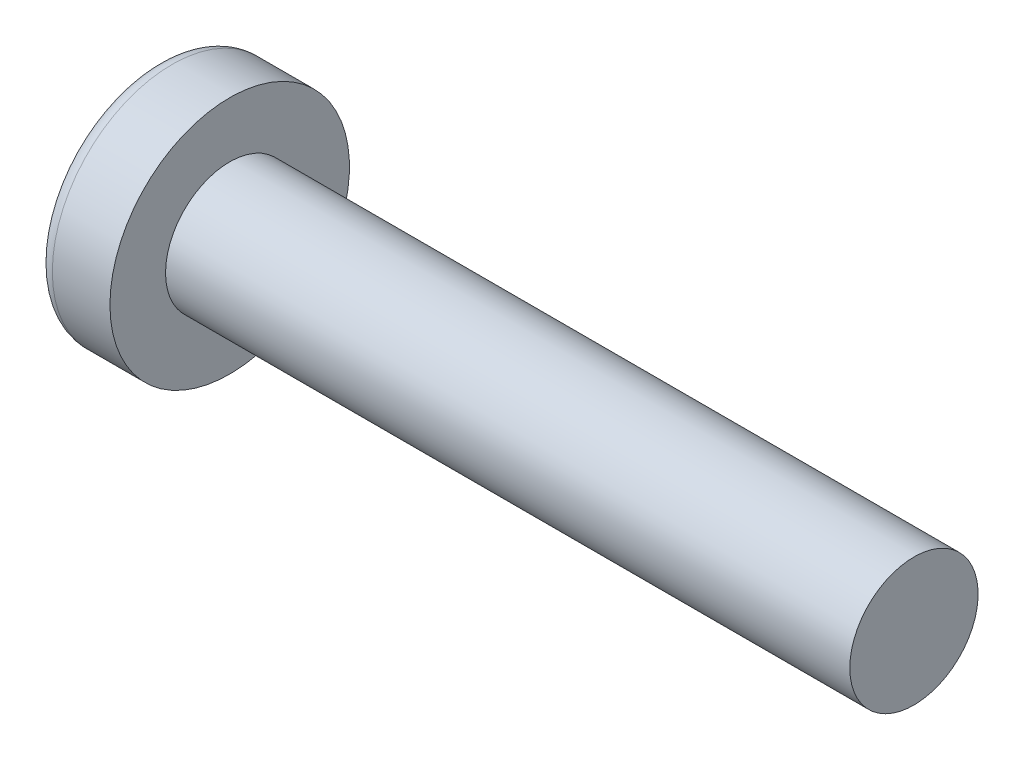
ISO-10303-21;
HEADER;
FILE_DESCRIPTION(('STEP AP214'),'2;1');
FILE_NAME('part.step','',(''),(''),'','','');
FILE_SCHEMA(('AUTOMOTIVE_DESIGN { 1 0 10303 214 1 1 1 1 }'));
ENDSEC;
DATA;
#1=APPLICATION_CONTEXT('core data for automotive mechanical design processes');
#2=APPLICATION_PROTOCOL_DEFINITION('international standard','automotive_design',2000,#1);
#3=PRODUCT_CONTEXT('',#1,'mechanical');
#4=PRODUCT('Part','Part','',(#3));
#5=PRODUCT_RELATED_PRODUCT_CATEGORY('part','',(#4));
#6=PRODUCT_DEFINITION_FORMATION('','',#4);
#7=PRODUCT_DEFINITION_CONTEXT('part definition',#1,'design');
#8=PRODUCT_DEFINITION('design','',#6,#7);
#9=PRODUCT_DEFINITION_SHAPE('','',#8);
#10=(LENGTH_UNIT() NAMED_UNIT(*) SI_UNIT(.MILLI.,.METRE.));
#11=(NAMED_UNIT(*) PLANE_ANGLE_UNIT() SI_UNIT($,.RADIAN.));
#12=(NAMED_UNIT(*) SI_UNIT($,.STERADIAN.) SOLID_ANGLE_UNIT());
#13=UNCERTAINTY_MEASURE_WITH_UNIT(LENGTH_MEASURE(1.E-05),#10,'distance_accuracy_value','');
#14=(GEOMETRIC_REPRESENTATION_CONTEXT(3) GLOBAL_UNCERTAINTY_ASSIGNED_CONTEXT((#13)) GLOBAL_UNIT_ASSIGNED_CONTEXT((#10,
#11,#12)) REPRESENTATION_CONTEXT('',''));
#15=CARTESIAN_POINT('',(0.,0.,0.));
#16=DIRECTION('',(0.,0.,1.));
#17=DIRECTION('',(1.,0.,0.));
#18=AXIS2_PLACEMENT_3D('',#15,#16,#17);
#19=CARTESIAN_POINT('',(5.,0.,0.));
#20=DIRECTION('',(-1.,0.,0.));
#21=DIRECTION('',(0.,1.,0.));
#22=AXIS2_PLACEMENT_3D('',#19,#20,#21);
#23=SPHERICAL_SURFACE('',#22,5.);
#24=CARTESIAN_POINT('',(0.747150706810477,0.,0.));
#25=DIRECTION('',(-1.,0.,0.));
#26=DIRECTION('',(0.,0.,1.));
#27=AXIS2_PLACEMENT_3D('',#24,#25,#26);
#28=CIRCLE('',#27,2.62931034482759);
#29=CARTESIAN_POINT('',(0.747150706810477,0.,2.62931034482759));
#30=VERTEX_POINT('',#29);
#31=EDGE_CURVE('E153',#30,#30,#28,.T.);
#32=ORIENTED_EDGE('',*,*,#31,.T.);
#33=EDGE_LOOP('',(#32));
#34=FACE_BOUND('',#33,.T.);
#35=CARTESIAN_POINT('',(4.98382636322272,-0.153868112043297,0.));
#36=DIRECTION('',(-0.104537710696287,-0.994520923380891,0.));
#37=DIRECTION('',(0.994520923380891,-0.104537710696287,0.));
#38=AXIS2_PLACEMENT_3D('',#35,#36,#37);
#39=CIRCLE('',#38,4.99760572850336);
#40=CARTESIAN_POINT('',(0.188596138461545,0.350175974082163,1.31444652548077));
#41=VERTEX_POINT('',#40);
#42=CARTESIAN_POINT('',(0.0270341343313616,0.367158343834486,0.367158343834487));
#43=VERTEX_POINT('',#42);
#44=EDGE_CURVE('E184',#41,#43,#39,.T.);
#45=ORIENTED_EDGE('',*,*,#44,.F.);
#46=CARTESIAN_POINT('',(3.98403090792016,0.,-1.41352221506761));
#47=DIRECTION('',(0.583636048152575,0.,0.812015371342713));
#48=DIRECTION('',(0.812015371342714,0.,-0.583636048152575));
#49=AXIS2_PLACEMENT_3D('',#46,#47,#48);
#50=CIRCLE('',#49,4.68719124331927);
#51=CARTESIAN_POINT('',(0.188596138461545,-0.350175974082172,1.31444652548076));
#52=VERTEX_POINT('',#51);
#53=EDGE_CURVE('E149',#41,#52,#50,.T.);
#54=ORIENTED_EDGE('',*,*,#53,.T.);
#55=CARTESIAN_POINT('',(4.98382636322272,0.153868112043297,0.));
#56=DIRECTION('',(-0.104537710696287,0.994520923380891,0.));
#57=DIRECTION('',(-0.994520923380891,-0.104537710696287,0.));
#58=AXIS2_PLACEMENT_3D('',#55,#56,#57);
#59=CIRCLE('',#58,4.99760572850336);
#60=CARTESIAN_POINT('',(0.0270341343313607,-0.367158343834489,0.367158343834487));
#61=VERTEX_POINT('',#60);
#62=EDGE_CURVE('E105',#61,#52,#59,.T.);
#63=ORIENTED_EDGE('',*,*,#62,.F.);
#64=CARTESIAN_POINT('',(4.98382636322272,0.,-0.153868112043297));
#65=DIRECTION('',(-0.104537710696287,0.,-0.994520923380891));
#66=DIRECTION('',(-0.994520923380891,0.,0.104537710696287));
#67=AXIS2_PLACEMENT_3D('',#64,#65,#66);
#68=CIRCLE('',#67,4.99760572850336);
#69=CARTESIAN_POINT('',(0.188596138461544,-1.31444652548077,0.350175974082167));
#70=VERTEX_POINT('',#69);
#71=EDGE_CURVE('E130',#70,#61,#68,.T.);
#72=ORIENTED_EDGE('',*,*,#71,.F.);
#73=CARTESIAN_POINT('',(3.98403090792016,1.41352221506761,0.));
#74=DIRECTION('',(0.583636048152575,-0.812015371342713,0.));
#75=DIRECTION('',(0.812015371342714,0.583636048152575,0.));
#76=AXIS2_PLACEMENT_3D('',#73,#74,#75);
#77=CIRCLE('',#76,4.68719124331927);
#78=CARTESIAN_POINT('',(0.188596138461544,-1.31444652548077,-0.350175974082167));
#79=VERTEX_POINT('',#78);
#80=EDGE_CURVE('E138',#70,#79,#77,.T.);
#81=ORIENTED_EDGE('',*,*,#80,.T.);
#82=CARTESIAN_POINT('',(4.98382636322272,0.,0.153868112043297));
#83=DIRECTION('',(-0.104537710696287,0.,0.994520923380891));
#84=DIRECTION('',(0.994520923380891,0.,0.104537710696287));
#85=AXIS2_PLACEMENT_3D('',#82,#83,#84);
#86=CIRCLE('',#85,4.99760572850336);
#87=CARTESIAN_POINT('',(0.0270341343313616,-0.367158343834486,-0.367158343834488));
#88=VERTEX_POINT('',#87);
#89=EDGE_CURVE('E48',#88,#79,#86,.T.);
#90=ORIENTED_EDGE('',*,*,#89,.F.);
#91=CARTESIAN_POINT('',(0.188596138461544,-0.350175974082162,-1.31444652548077));
#92=VERTEX_POINT('',#91);
#93=EDGE_CURVE('E191',#92,#88,#59,.T.);
#94=ORIENTED_EDGE('',*,*,#93,.F.);
#95=CARTESIAN_POINT('',(3.98403090792016,0.,1.41352221506761));
#96=DIRECTION('',(0.583636048152575,0.,-0.812015371342713));
#97=DIRECTION('',(-0.812015371342714,0.,-0.583636048152575));
#98=AXIS2_PLACEMENT_3D('',#95,#96,#97);
#99=CIRCLE('',#98,4.68719124331927);
#100=CARTESIAN_POINT('',(0.188596138461544,0.350175974082172,-1.31444652548076));
#101=VERTEX_POINT('',#100);
#102=EDGE_CURVE('E131',#92,#101,#99,.T.);
#103=ORIENTED_EDGE('',*,*,#102,.T.);
#104=CARTESIAN_POINT('',(0.0270341343313607,0.367158343834489,-0.367158343834488));
#105=VERTEX_POINT('',#104);
#106=EDGE_CURVE('E179',#105,#101,#39,.T.);
#107=ORIENTED_EDGE('',*,*,#106,.F.);
#108=CARTESIAN_POINT('',(0.188596138461544,1.31444652548076,-0.350175974082167));
#109=VERTEX_POINT('',#108);
#110=EDGE_CURVE('E41',#109,#105,#86,.T.);
#111=ORIENTED_EDGE('',*,*,#110,.F.);
#112=CARTESIAN_POINT('',(3.98403090792016,-1.41352221506761,0.));
#113=DIRECTION('',(0.583636048152575,0.812015371342713,0.));
#114=DIRECTION('',(-0.812015371342714,0.583636048152575,0.));
#115=AXIS2_PLACEMENT_3D('',#112,#113,#114);
#116=CIRCLE('',#115,4.68719124331927);
#117=CARTESIAN_POINT('',(0.188596138461544,1.31444652548076,0.350175974082167));
#118=VERTEX_POINT('',#117);
#119=EDGE_CURVE('E11',#109,#118,#116,.T.);
#120=ORIENTED_EDGE('',*,*,#119,.T.);
#121=EDGE_CURVE('E167',#43,#118,#68,.T.);
#122=ORIENTED_EDGE('',*,*,#121,.F.);
#123=EDGE_LOOP('',(#45,#54,#63,#72,#81,#90,#94,#103,#107,#111,#120,#122));
#124=FACE_BOUND('',#123,.T.);
#125=ADVANCED_FACE('F33',(#34,#124),#23,.T.);
#126=CARTESIAN_POINT('',(2.01739130434783,0.,-0.15794466403162));
#127=DIRECTION('',(-0.104537710696287,0.,0.994520923380891));
#128=DIRECTION('',(0.994520923380891,0.,0.104537710696287));
#129=AXIS2_PLACEMENT_3D('',#126,#127,#128);
#130=PLANE('',#129);
#131=ORIENTED_EDGE('',*,*,#110,.T.);
#132=DIRECTION('',(0.989130931836555,-0.103971149085093,0.103971149085092));
#133=VECTOR('',#132,1.);
#134=CARTESIAN_POINT('',(2.03363450411053,0.156237282238383,-0.156237282238382));
#135=LINE('',#134,#133);
#136=CARTESIAN_POINT('',(1.76,0.185000000000001,-0.184999999999999));
#137=VERTEX_POINT('',#136);
#138=EDGE_CURVE('E173',#105,#137,#135,.T.);
#139=ORIENTED_EDGE('',*,*,#138,.T.);
#140=DIRECTION('',(0.80907355338853,-0.581521616498006,0.0850446632823171));
#141=VECTOR('',#140,1.);
#142=CARTESIAN_POINT('',(0.,1.45,-0.37));
#143=LINE('',#142,#141);
#144=EDGE_CURVE('E154',#109,#137,#143,.T.);
#145=ORIENTED_EDGE('',*,*,#144,.F.);
#146=EDGE_LOOP('',(#131,#139,#145));
#147=FACE_BOUND('',#146,.T.);
#148=ADVANCED_FACE('F172',(#147),#130,.T.);
#149=DIRECTION('',(0.80907355338853,0.581521616498006,0.0850446632823171));
#150=VECTOR('',#149,1.);
#151=CARTESIAN_POINT('',(0.,-1.45,-0.37));
#152=LINE('',#151,#150);
#153=CARTESIAN_POINT('',(1.76,-0.185,-0.185));
#154=VERTEX_POINT('',#153);
#155=EDGE_CURVE('E139',#79,#154,#152,.T.);
#156=ORIENTED_EDGE('',*,*,#155,.T.);
#157=DIRECTION('',(-0.989130931836555,-0.103971149085092,-0.103971149085092));
#158=VECTOR('',#157,1.);
#159=CARTESIAN_POINT('',(2.03363450411053,-0.156237282238382,-0.156237282238382));
#160=LINE('',#159,#158);
#161=EDGE_CURVE('E194',#154,#88,#160,.T.);
#162=ORIENTED_EDGE('',*,*,#161,.T.);
#163=ORIENTED_EDGE('',*,*,#89,.T.);
#164=EDGE_LOOP('',(#156,#162,#163));
#165=FACE_BOUND('',#164,.T.);
#166=ADVANCED_FACE('F209',(#165),#130,.T.);
#167=CARTESIAN_POINT('',(2.01739130434783,0.,0.15794466403162));
#168=DIRECTION('',(-0.104537710696287,0.,-0.994520923380891));
#169=DIRECTION('',(-0.994520923380891,0.,0.104537710696287));
#170=AXIS2_PLACEMENT_3D('',#167,#168,#169);
#171=PLANE('',#170);
#172=DIRECTION('',(0.80907355338853,-0.581521616498006,-0.0850446632823171));
#173=VECTOR('',#172,1.);
#174=CARTESIAN_POINT('',(0.,1.45,0.37));
#175=LINE('',#174,#173);
#176=CARTESIAN_POINT('',(1.76,0.185,0.185));
#177=VERTEX_POINT('',#176);
#178=EDGE_CURVE('E210',#118,#177,#175,.T.);
#179=ORIENTED_EDGE('',*,*,#178,.T.);
#180=DIRECTION('',(-0.989130931836555,0.103971149085092,0.103971149085092));
#181=VECTOR('',#180,1.);
#182=CARTESIAN_POINT('',(2.03363450411053,0.156237282238382,0.156237282238382));
#183=LINE('',#182,#181);
#184=EDGE_CURVE('E188',#177,#43,#183,.T.);
#185=ORIENTED_EDGE('',*,*,#184,.T.);
#186=ORIENTED_EDGE('',*,*,#121,.T.);
#187=EDGE_LOOP('',(#179,#185,#186));
#188=FACE_BOUND('',#187,.T.);
#189=ADVANCED_FACE('F214',(#188),#171,.T.);
#190=ORIENTED_EDGE('',*,*,#71,.T.);
#191=DIRECTION('',(0.989130931836555,0.103971149085093,-0.103971149085092));
#192=VECTOR('',#191,1.);
#193=CARTESIAN_POINT('',(2.03363450411053,-0.156237282238383,0.156237282238382));
#194=LINE('',#193,#192);
#195=CARTESIAN_POINT('',(1.76,-0.185000000000001,0.184999999999999));
#196=VERTEX_POINT('',#195);
#197=EDGE_CURVE('E103',#61,#196,#194,.T.);
#198=ORIENTED_EDGE('',*,*,#197,.T.);
#199=DIRECTION('',(0.80907355338853,0.581521616498006,-0.085044663282317));
#200=VECTOR('',#199,1.);
#201=CARTESIAN_POINT('',(0.,-1.45,0.37));
#202=LINE('',#201,#200);
#203=EDGE_CURVE('E128',#70,#196,#202,.T.);
#204=ORIENTED_EDGE('',*,*,#203,.F.);
#205=EDGE_LOOP('',(#190,#198,#204));
#206=FACE_BOUND('',#205,.T.);
#207=ADVANCED_FACE('F127',(#206),#171,.T.);
#208=CARTESIAN_POINT('',(-25.4,0.,0.));
#209=DIRECTION('',(-1.,0.,0.));
#210=DIRECTION('',(0.,0.,1.));
#211=AXIS2_PLACEMENT_3D('',#208,#209,#210);
#212=CYLINDRICAL_SURFACE('',#211,1.5);
#213=CARTESIAN_POINT('',(18.4,0.,0.));
#214=DIRECTION('',(-1.,0.,0.));
#215=DIRECTION('',(0.,0.,1.));
#216=AXIS2_PLACEMENT_3D('',#213,#214,#215);
#217=CIRCLE('',#216,1.5);
#218=CARTESIAN_POINT('',(18.4,0.,1.5));
#219=VERTEX_POINT('',#218);
#220=EDGE_CURVE('E150',#219,#219,#217,.T.);
#221=ORIENTED_EDGE('',*,*,#220,.T.);
#222=EDGE_LOOP('',(#221));
#223=FACE_BOUND('',#222,.T.);
#224=CARTESIAN_POINT('',(2.4,0.,0.));
#225=DIRECTION('',(-1.,0.,0.));
#226=DIRECTION('',(0.,0.,1.));
#227=AXIS2_PLACEMENT_3D('',#224,#225,#226);
#228=CIRCLE('',#227,1.5);
#229=CARTESIAN_POINT('',(2.4,0.,1.5));
#230=VERTEX_POINT('',#229);
#231=EDGE_CURVE('E163',#230,#230,#228,.T.);
#232=ORIENTED_EDGE('',*,*,#231,.F.);
#233=EDGE_LOOP('',(#232));
#234=FACE_BOUND('',#233,.T.);
#235=ADVANCED_FACE('F35',(#223,#234),#212,.T.);
#236=CARTESIAN_POINT('',(2.4,1.5,0.));
#237=DIRECTION('',(-1.,0.,0.));
#238=DIRECTION('',(0.,0.,1.));
#239=AXIS2_PLACEMENT_3D('',#236,#237,#238);
#240=PLANE('',#239);
#241=CARTESIAN_POINT('',(2.4,0.,0.));
#242=DIRECTION('',(-1.,0.,0.));
#243=DIRECTION('',(0.,0.,1.));
#244=AXIS2_PLACEMENT_3D('',#241,#242,#243);
#245=CIRCLE('',#244,2.8);
#246=CARTESIAN_POINT('',(2.4,0.,2.8));
#247=VERTEX_POINT('',#246);
#248=EDGE_CURVE('E160',#247,#247,#245,.T.);
#249=ORIENTED_EDGE('',*,*,#248,.F.);
#250=EDGE_LOOP('',(#249));
#251=FACE_BOUND('',#250,.T.);
#252=ORIENTED_EDGE('',*,*,#231,.T.);
#253=EDGE_LOOP('',(#252));
#254=FACE_BOUND('',#253,.T.);
#255=ADVANCED_FACE('F242',(#251,#254),#240,.F.);
#256=CARTESIAN_POINT('',(-25.4,0.,0.));
#257=DIRECTION('',(-1.,0.,0.));
#258=DIRECTION('',(0.,0.,1.));
#259=AXIS2_PLACEMENT_3D('',#256,#257,#258);
#260=CYLINDRICAL_SURFACE('',#259,2.8);
#261=ORIENTED_EDGE('',*,*,#248,.T.);
#262=EDGE_LOOP('',(#261));
#263=FACE_BOUND('',#262,.T.);
#264=CARTESIAN_POINT('',(1.05335585592012,0.,0.));
#265=DIRECTION('',(-1.,0.,0.));
#266=DIRECTION('',(0.,0.,1.));
#267=AXIS2_PLACEMENT_3D('',#264,#265,#266);
#268=CIRCLE('',#267,2.8);
#269=CARTESIAN_POINT('',(1.05335585592012,0.,2.8));
#270=VERTEX_POINT('',#269);
#271=EDGE_CURVE('E157',#270,#270,#268,.T.);
#272=ORIENTED_EDGE('',*,*,#271,.F.);
#273=EDGE_LOOP('',(#272));
#274=FACE_BOUND('',#273,.T.);
#275=ADVANCED_FACE('F239',(#263,#274),#260,.T.);
#276=CARTESIAN_POINT('',(1.05335585592012,0.,0.));
#277=DIRECTION('',(-1.,0.,0.));
#278=DIRECTION('',(0.,0.,1.));
#279=AXIS2_PLACEMENT_3D('',#276,#277,#278);
#280=TOROIDAL_SURFACE('',#279,2.44,0.360000000000001);
#281=ORIENTED_EDGE('',*,*,#271,.T.);
#282=EDGE_LOOP('',(#281));
#283=FACE_BOUND('',#282,.T.);
#284=ORIENTED_EDGE('',*,*,#31,.F.);
#285=EDGE_LOOP('',(#284));
#286=FACE_BOUND('',#285,.T.);
#287=ADVANCED_FACE('F236',(#283,#286),#280,.T.);
#288=CARTESIAN_POINT('',(18.4,1.5,0.));
#289=DIRECTION('',(1.,0.,0.));
#290=DIRECTION('',(0.,0.,-1.));
#291=AXIS2_PLACEMENT_3D('',#288,#289,#290);
#292=PLANE('',#291);
#293=ORIENTED_EDGE('',*,*,#220,.F.);
#294=EDGE_LOOP('',(#293));
#295=FACE_BOUND('',#294,.T.);
#296=ADVANCED_FACE('F234',(#295),#292,.T.);
#297=CARTESIAN_POINT('',(1.76,0.185,0.185));
#298=DIRECTION('',(0.583636048152575,0.812015371342713,0.));
#299=DIRECTION('',(-0.812015371342714,0.583636048152575,0.));
#300=AXIS2_PLACEMENT_3D('',#297,#298,#299);
#301=PLANE('',#300);
#302=ORIENTED_EDGE('',*,*,#144,.T.);
#303=DIRECTION('',(0.,0.,-1.));
#304=VECTOR('',#303,1.);
#305=CARTESIAN_POINT('',(1.76,0.185,0.185));
#306=LINE('',#305,#304);
#307=EDGE_CURVE('E121',#177,#137,#306,.T.);
#308=ORIENTED_EDGE('',*,*,#307,.F.);
#309=ORIENTED_EDGE('',*,*,#178,.F.);
#310=ORIENTED_EDGE('',*,*,#119,.F.);
#311=EDGE_LOOP('',(#302,#308,#309,#310));
#312=FACE_BOUND('',#311,.T.);
#313=ADVANCED_FACE('F213',(#312),#301,.F.);
#314=CARTESIAN_POINT('',(1.76,-0.185,-0.185));
#315=DIRECTION('',(0.583636048152575,-0.812015371342713,0.));
#316=DIRECTION('',(0.812015371342714,0.583636048152575,0.));
#317=AXIS2_PLACEMENT_3D('',#314,#315,#316);
#318=PLANE('',#317);
#319=ORIENTED_EDGE('',*,*,#203,.T.);
#320=DIRECTION('',(0.,0.,1.));
#321=VECTOR('',#320,1.);
#322=CARTESIAN_POINT('',(1.76,-0.185,-0.185));
#323=LINE('',#322,#321);
#324=EDGE_CURVE('E120',#154,#196,#323,.T.);
#325=ORIENTED_EDGE('',*,*,#324,.F.);
#326=ORIENTED_EDGE('',*,*,#155,.F.);
#327=ORIENTED_EDGE('',*,*,#80,.F.);
#328=EDGE_LOOP('',(#319,#325,#326,#327));
#329=FACE_BOUND('',#328,.T.);
#330=ADVANCED_FACE('F135',(#329),#318,.F.);
#331=CARTESIAN_POINT('',(1.76,0.185,-0.185));
#332=DIRECTION('',(-1.,0.,0.));
#333=DIRECTION('',(0.,0.,1.));
#334=AXIS2_PLACEMENT_3D('',#331,#332,#333);
#335=PLANE('',#334);
#336=DIRECTION('',(0.,1.,0.));
#337=VECTOR('',#336,1.);
#338=CARTESIAN_POINT('',(1.76,-0.185,-0.185));
#339=LINE('',#338,#337);
#340=EDGE_CURVE('E143',#154,#137,#339,.T.);
#341=ORIENTED_EDGE('',*,*,#340,.F.);
#342=ORIENTED_EDGE('',*,*,#324,.T.);
#343=DIRECTION('',(0.,-1.,0.));
#344=VECTOR('',#343,1.);
#345=CARTESIAN_POINT('',(1.76,0.185,0.185));
#346=LINE('',#345,#344);
#347=EDGE_CURVE('E112',#177,#196,#346,.T.);
#348=ORIENTED_EDGE('',*,*,#347,.F.);
#349=ORIENTED_EDGE('',*,*,#307,.T.);
#350=EDGE_LOOP('',(#341,#342,#348,#349));
#351=FACE_BOUND('',#350,.T.);
#352=ADVANCED_FACE('F141',(#351),#335,.T.);
#353=CARTESIAN_POINT('',(1.76,0.185000000000001,-0.184999999999999));
#354=DIRECTION('',(0.583636048152575,0.,-0.812015371342713));
#355=DIRECTION('',(0.812015371342714,0.,0.583636048152575));
#356=AXIS2_PLACEMENT_3D('',#353,#354,#355);
#357=PLANE('',#356);
#358=DIRECTION('',(0.80907355338853,0.085044663282315,0.581521616498006));
#359=VECTOR('',#358,1.);
#360=CARTESIAN_POINT('',(0.,-0.369999999999995,-1.45));
#361=LINE('',#360,#359);
#362=EDGE_CURVE('E199',#92,#154,#361,.T.);
#363=ORIENTED_EDGE('',*,*,#362,.T.);
#364=ORIENTED_EDGE('',*,*,#340,.T.);
#365=DIRECTION('',(0.80907355338853,-0.0850446632823191,0.581521616498006));
#366=VECTOR('',#365,1.);
#367=CARTESIAN_POINT('',(0.,0.370000000000005,-1.45));
#368=LINE('',#367,#366);
#369=EDGE_CURVE('E109',#101,#137,#368,.T.);
#370=ORIENTED_EDGE('',*,*,#369,.F.);
#371=ORIENTED_EDGE('',*,*,#102,.F.);
#372=EDGE_LOOP('',(#363,#364,#370,#371));
#373=FACE_BOUND('',#372,.T.);
#374=ADVANCED_FACE('F204',(#373),#357,.F.);
#375=CARTESIAN_POINT('',(2.01739130434783,-0.15794466403162,0.));
#376=DIRECTION('',(-0.104537710696287,0.994520923380891,0.));
#377=DIRECTION('',(-0.994520923380891,-0.104537710696287,0.));
#378=AXIS2_PLACEMENT_3D('',#375,#376,#377);
#379=PLANE('',#378);
#380=ORIENTED_EDGE('',*,*,#93,.T.);
#381=ORIENTED_EDGE('',*,*,#161,.F.);
#382=ORIENTED_EDGE('',*,*,#362,.F.);
#383=EDGE_LOOP('',(#380,#381,#382));
#384=FACE_BOUND('',#383,.T.);
#385=ADVANCED_FACE('F208',(#384),#379,.T.);
#386=CARTESIAN_POINT('',(2.01739130434783,0.15794466403162,0.));
#387=DIRECTION('',(-0.104537710696287,-0.994520923380891,0.));
#388=DIRECTION('',(0.994520923380891,-0.104537710696287,0.));
#389=AXIS2_PLACEMENT_3D('',#386,#387,#388);
#390=PLANE('',#389);
#391=ORIENTED_EDGE('',*,*,#106,.T.);
#392=ORIENTED_EDGE('',*,*,#369,.T.);
#393=ORIENTED_EDGE('',*,*,#138,.F.);
#394=EDGE_LOOP('',(#391,#392,#393));
#395=FACE_BOUND('',#394,.T.);
#396=ADVANCED_FACE('F202',(#395),#390,.T.);
#397=CARTESIAN_POINT('',(1.76,-0.185000000000001,0.184999999999999));
#398=DIRECTION('',(0.583636048152575,0.,0.812015371342713));
#399=DIRECTION('',(-0.812015371342714,0.,0.583636048152575));
#400=AXIS2_PLACEMENT_3D('',#397,#398,#399);
#401=PLANE('',#400);
#402=DIRECTION('',(0.80907355338853,-0.0850446632823151,-0.581521616498006));
#403=VECTOR('',#402,1.);
#404=CARTESIAN_POINT('',(0.,0.369999999999995,1.45));
#405=LINE('',#404,#403);
#406=EDGE_CURVE('E108',#41,#177,#405,.T.);
#407=ORIENTED_EDGE('',*,*,#406,.T.);
#408=ORIENTED_EDGE('',*,*,#347,.T.);
#409=DIRECTION('',(0.80907355338853,0.0850446632823192,-0.581521616498006));
#410=VECTOR('',#409,1.);
#411=CARTESIAN_POINT('',(0.,-0.370000000000005,1.45));
#412=LINE('',#411,#410);
#413=EDGE_CURVE('E99',#52,#196,#412,.T.);
#414=ORIENTED_EDGE('',*,*,#413,.F.);
#415=ORIENTED_EDGE('',*,*,#53,.F.);
#416=EDGE_LOOP('',(#407,#408,#414,#415));
#417=FACE_BOUND('',#416,.T.);
#418=ADVANCED_FACE('F113',(#417),#401,.F.);
#419=ORIENTED_EDGE('',*,*,#44,.T.);
#420=ORIENTED_EDGE('',*,*,#184,.F.);
#421=ORIENTED_EDGE('',*,*,#406,.F.);
#422=EDGE_LOOP('',(#419,#420,#421));
#423=FACE_BOUND('',#422,.T.);
#424=ADVANCED_FACE('F215',(#423),#390,.T.);
#425=ORIENTED_EDGE('',*,*,#62,.T.);
#426=ORIENTED_EDGE('',*,*,#413,.T.);
#427=ORIENTED_EDGE('',*,*,#197,.F.);
#428=EDGE_LOOP('',(#425,#426,#427));
#429=FACE_BOUND('',#428,.T.);
#430=ADVANCED_FACE('F101',(#429),#379,.T.);
#431=CLOSED_SHELL('',(#125,#148,#166,#189,#207,#235,#255,#275,#287,#296,#313,#330,#352,#374,
#385,#396,#418,#424,#430));
#432=MANIFOLD_SOLID_BREP('B2',#431);
#433=ADVANCED_BREP_SHAPE_REPRESENTATION('',(#18,#432),#14);
#434=SHAPE_DEFINITION_REPRESENTATION(#9,#433);
ENDSEC;
END-ISO-10303-21;
